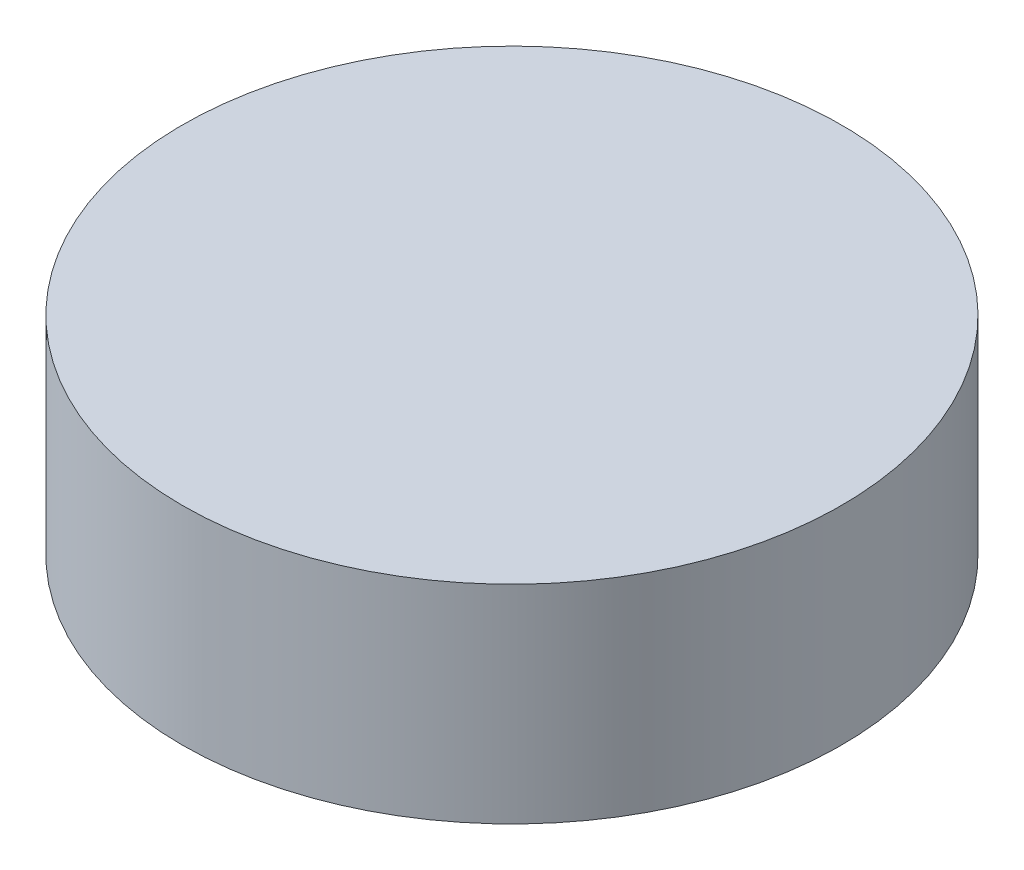
ISO-10303-21;
HEADER;
FILE_DESCRIPTION(('STEP AP214'),'2;1');
FILE_NAME('part.step','',(''),(''),'','','');
FILE_SCHEMA(('AUTOMOTIVE_DESIGN { 1 0 10303 214 1 1 1 1 }'));
ENDSEC;
DATA;
#1=APPLICATION_CONTEXT('core data for automotive mechanical design processes');
#2=APPLICATION_PROTOCOL_DEFINITION('international standard','automotive_design',2000,#1);
#3=PRODUCT_CONTEXT('',#1,'mechanical');
#4=PRODUCT('Part','Part','',(#3));
#5=PRODUCT_RELATED_PRODUCT_CATEGORY('part','',(#4));
#6=PRODUCT_DEFINITION_FORMATION('','',#4);
#7=PRODUCT_DEFINITION_CONTEXT('part definition',#1,'design');
#8=PRODUCT_DEFINITION('design','',#6,#7);
#9=PRODUCT_DEFINITION_SHAPE('','',#8);
#10=(LENGTH_UNIT() NAMED_UNIT(*) SI_UNIT(.MILLI.,.METRE.));
#11=(NAMED_UNIT(*) PLANE_ANGLE_UNIT() SI_UNIT($,.RADIAN.));
#12=(NAMED_UNIT(*) SI_UNIT($,.STERADIAN.) SOLID_ANGLE_UNIT());
#13=UNCERTAINTY_MEASURE_WITH_UNIT(LENGTH_MEASURE(1.E-05),#10,'distance_accuracy_value','');
#14=(GEOMETRIC_REPRESENTATION_CONTEXT(3) GLOBAL_UNCERTAINTY_ASSIGNED_CONTEXT((#13)) GLOBAL_UNIT_ASSIGNED_CONTEXT((#10,
#11,#12)) REPRESENTATION_CONTEXT('',''));
#15=CARTESIAN_POINT('',(0.,0.,0.));
#16=DIRECTION('',(0.,0.,1.));
#17=DIRECTION('',(1.,0.,0.));
#18=AXIS2_PLACEMENT_3D('',#15,#16,#17);
#19=CARTESIAN_POINT('',(0.,4.,0.));
#20=DIRECTION('',(0.,-1.,0.));
#21=DIRECTION('',(0.,0.,-1.));
#22=AXIS2_PLACEMENT_3D('',#19,#20,#21);
#23=CYLINDRICAL_SURFACE('',#22,6.35);
#24=CARTESIAN_POINT('',(0.,4.,0.));
#25=DIRECTION('',(0.,1.,0.));
#26=DIRECTION('',(0.,0.,1.));
#27=AXIS2_PLACEMENT_3D('',#24,#25,#26);
#28=CIRCLE('',#27,6.35);
#29=CARTESIAN_POINT('',(0.,4.,6.35));
#30=VERTEX_POINT('',#29);
#31=EDGE_CURVE('E12',#30,#30,#28,.T.);
#32=ORIENTED_EDGE('',*,*,#31,.F.);
#33=EDGE_LOOP('',(#32));
#34=FACE_BOUND('',#33,.T.);
#35=CARTESIAN_POINT('',(0.,0.,0.));
#36=DIRECTION('',(0.,1.,0.));
#37=DIRECTION('',(0.,0.,1.));
#38=AXIS2_PLACEMENT_3D('',#35,#36,#37);
#39=CIRCLE('',#38,6.35);
#40=CARTESIAN_POINT('',(0.,0.,6.35));
#41=VERTEX_POINT('',#40);
#42=EDGE_CURVE('E48',#41,#41,#39,.T.);
#43=ORIENTED_EDGE('',*,*,#42,.T.);
#44=EDGE_LOOP('',(#43));
#45=FACE_BOUND('',#44,.T.);
#46=ADVANCED_FACE('F45',(#34,#45),#23,.T.);
#47=CARTESIAN_POINT('',(0.,4.,0.));
#48=DIRECTION('',(0.,1.,0.));
#49=DIRECTION('',(0.,0.,1.));
#50=AXIS2_PLACEMENT_3D('',#47,#48,#49);
#51=PLANE('',#50);
#52=ORIENTED_EDGE('',*,*,#31,.T.);
#53=EDGE_LOOP('',(#52));
#54=FACE_BOUND('',#53,.T.);
#55=ADVANCED_FACE('F148',(#54),#51,.T.);
#56=CARTESIAN_POINT('',(0.,0.,0.));
#57=DIRECTION('',(0.,1.,0.));
#58=DIRECTION('',(0.,0.,1.));
#59=AXIS2_PLACEMENT_3D('',#56,#57,#58);
#60=PLANE('',#59);
#61=CARTESIAN_POINT('',(0.,0.,4.2));
#62=DIRECTION('',(0.,-1.,0.));
#63=DIRECTION('',(0.,0.,-1.));
#64=AXIS2_PLACEMENT_3D('',#61,#62,#63);
#65=CIRCLE('',#64,1.);
#66=CARTESIAN_POINT('',(0.992888545809194,0.,4.08095238095238));
#67=VERTEX_POINT('',#66);
#68=CARTESIAN_POINT('',(-0.992888545809194,0.,4.08095238095238));
#69=VERTEX_POINT('',#68);
#70=EDGE_CURVE('E102',#67,#69,#65,.T.);
#71=ORIENTED_EDGE('',*,*,#70,.F.);
#72=CARTESIAN_POINT('',(0.,0.,0.));
#73=DIRECTION('',(0.,-1.,0.));
#74=DIRECTION('',(0.,0.,-1.));
#75=AXIS2_PLACEMENT_3D('',#72,#73,#74);
#76=CIRCLE('',#75,4.2);
#77=CARTESIAN_POINT('',(0.992888545809194,0.,-4.08095238095238));
#78=VERTEX_POINT('',#77);
#79=EDGE_CURVE('E86',#78,#67,#76,.T.);
#80=ORIENTED_EDGE('',*,*,#79,.F.);
#81=CARTESIAN_POINT('',(0.,0.,-4.2));
#82=DIRECTION('',(0.,-1.,0.));
#83=DIRECTION('',(0.,0.,-1.));
#84=AXIS2_PLACEMENT_3D('',#81,#82,#83);
#85=CIRCLE('',#84,1.);
#86=CARTESIAN_POINT('',(-0.992888545809194,0.,-4.08095238095238));
#87=VERTEX_POINT('',#86);
#88=EDGE_CURVE('E122',#87,#78,#85,.T.);
#89=ORIENTED_EDGE('',*,*,#88,.F.);
#90=EDGE_CURVE('E96',#69,#87,#76,.T.);
#91=ORIENTED_EDGE('',*,*,#90,.F.);
#92=EDGE_LOOP('',(#71,#80,#89,#91));
#93=FACE_BOUND('',#92,.T.);
#94=ORIENTED_EDGE('',*,*,#42,.F.);
#95=EDGE_LOOP('',(#94));
#96=FACE_BOUND('',#95,.T.);
#97=ADVANCED_FACE('F107',(#93,#96),#60,.F.);
#98=CARTESIAN_POINT('',(0.,0.999999999999997,-4.2));
#99=DIRECTION('',(0.,-1.,0.));
#100=DIRECTION('',(0.,0.,-1.));
#101=AXIS2_PLACEMENT_3D('',#98,#99,#100);
#102=CYLINDRICAL_SURFACE('',#101,1.);
#103=CARTESIAN_POINT('',(0.,0.999999999999997,-4.2));
#104=DIRECTION('',(0.,-1.,0.));
#105=DIRECTION('',(0.,0.,-1.));
#106=AXIS2_PLACEMENT_3D('',#103,#104,#105);
#107=CIRCLE('',#106,1.);
#108=CARTESIAN_POINT('',(-0.992888545809193,0.999999999999997,-4.08095238095238));
#109=VERTEX_POINT('',#108);
#110=CARTESIAN_POINT('',(0.992888545809193,0.999999999999997,-4.08095238095238));
#111=VERTEX_POINT('',#110);
#112=EDGE_CURVE('E123',#109,#111,#107,.T.);
#113=ORIENTED_EDGE('',*,*,#112,.F.);
#114=DIRECTION('',(0.,-1.,0.));
#115=VECTOR('',#114,1.);
#116=CARTESIAN_POINT('',(-0.992888545809193,0.499999999999999,-4.08095238095238));
#117=LINE('',#116,#115);
#118=EDGE_CURVE('E118',#109,#87,#117,.T.);
#119=ORIENTED_EDGE('',*,*,#118,.T.);
#120=ORIENTED_EDGE('',*,*,#88,.T.);
#121=DIRECTION('',(0.,-1.,0.));
#122=VECTOR('',#121,1.);
#123=CARTESIAN_POINT('',(0.992888545809193,0.499999999999999,-4.08095238095238));
#124=LINE('',#123,#122);
#125=EDGE_CURVE('E68',#78,#111,#124,.F.);
#126=ORIENTED_EDGE('',*,*,#125,.T.);
#127=EDGE_LOOP('',(#113,#119,#120,#126));
#128=FACE_BOUND('',#127,.T.);
#129=ADVANCED_FACE('F129',(#128),#102,.F.);
#130=CARTESIAN_POINT('',(0.,0.999999999999997,-4.2));
#131=DIRECTION('',(0.,-1.,0.));
#132=DIRECTION('',(0.,0.,-1.));
#133=AXIS2_PLACEMENT_3D('',#130,#131,#132);
#134=PLANE('',#133);
#135=ORIENTED_EDGE('',*,*,#112,.T.);
#136=CARTESIAN_POINT('',(0.,0.999999999999997,0.));
#137=DIRECTION('',(0.,-1.,0.));
#138=DIRECTION('',(0.,0.,-1.));
#139=AXIS2_PLACEMENT_3D('',#136,#137,#138);
#140=CIRCLE('',#139,4.2);
#141=CARTESIAN_POINT('',(0.992888545809194,0.999999999999997,4.08095238095238));
#142=VERTEX_POINT('',#141);
#143=EDGE_CURVE('E133',#111,#142,#140,.T.);
#144=ORIENTED_EDGE('',*,*,#143,.T.);
#145=CARTESIAN_POINT('',(0.,0.999999999999997,4.2));
#146=DIRECTION('',(0.,-1.,0.));
#147=DIRECTION('',(0.,0.,-1.));
#148=AXIS2_PLACEMENT_3D('',#145,#146,#147);
#149=CIRCLE('',#148,1.);
#150=CARTESIAN_POINT('',(-0.992888545809194,0.999999999999997,4.08095238095238));
#151=VERTEX_POINT('',#150);
#152=EDGE_CURVE('E97',#142,#151,#149,.T.);
#153=ORIENTED_EDGE('',*,*,#152,.T.);
#154=EDGE_CURVE('E60',#151,#109,#140,.T.);
#155=ORIENTED_EDGE('',*,*,#154,.T.);
#156=EDGE_LOOP('',(#135,#144,#153,#155));
#157=FACE_BOUND('',#156,.T.);
#158=ADVANCED_FACE('F137',(#157),#134,.T.);
#159=CARTESIAN_POINT('',(0.,0.999999999999997,0.));
#160=DIRECTION('',(0.,-1.,0.));
#161=DIRECTION('',(0.,0.,-1.));
#162=AXIS2_PLACEMENT_3D('',#159,#160,#161);
#163=CYLINDRICAL_SURFACE('',#162,4.2);
#164=ORIENTED_EDGE('',*,*,#154,.F.);
#165=DIRECTION('',(0.,-1.,0.));
#166=VECTOR('',#165,1.);
#167=CARTESIAN_POINT('',(-0.992888545809193,0.499999999999999,4.08095238095238));
#168=LINE('',#167,#166);
#169=EDGE_CURVE('E105',#151,#69,#168,.T.);
#170=ORIENTED_EDGE('',*,*,#169,.T.);
#171=ORIENTED_EDGE('',*,*,#90,.T.);
#172=ORIENTED_EDGE('',*,*,#118,.F.);
#173=EDGE_LOOP('',(#164,#170,#171,#172));
#174=FACE_BOUND('',#173,.T.);
#175=ADVANCED_FACE('F131',(#174),#163,.F.);
#176=ORIENTED_EDGE('',*,*,#79,.T.);
#177=DIRECTION('',(0.,-1.,0.));
#178=VECTOR('',#177,1.);
#179=CARTESIAN_POINT('',(0.992888545809193,0.499999999999999,4.08095238095238));
#180=LINE('',#179,#178);
#181=EDGE_CURVE('E89',#67,#142,#180,.F.);
#182=ORIENTED_EDGE('',*,*,#181,.T.);
#183=ORIENTED_EDGE('',*,*,#143,.F.);
#184=ORIENTED_EDGE('',*,*,#125,.F.);
#185=EDGE_LOOP('',(#176,#182,#183,#184));
#186=FACE_BOUND('',#185,.T.);
#187=ADVANCED_FACE('F88',(#186),#163,.F.);
#188=CARTESIAN_POINT('',(0.,0.999999999999997,4.2));
#189=DIRECTION('',(0.,-1.,0.));
#190=DIRECTION('',(0.,0.,-1.));
#191=AXIS2_PLACEMENT_3D('',#188,#189,#190);
#192=CYLINDRICAL_SURFACE('',#191,1.);
#193=ORIENTED_EDGE('',*,*,#152,.F.);
#194=ORIENTED_EDGE('',*,*,#181,.F.);
#195=ORIENTED_EDGE('',*,*,#70,.T.);
#196=ORIENTED_EDGE('',*,*,#169,.F.);
#197=EDGE_LOOP('',(#193,#194,#195,#196));
#198=FACE_BOUND('',#197,.T.);
#199=ADVANCED_FACE('F101',(#198),#192,.F.);
#200=CLOSED_SHELL('',(#46,#55,#97,#129,#158,#175,#187,#199));
#201=MANIFOLD_SOLID_BREP('B2',#200);
#202=ADVANCED_BREP_SHAPE_REPRESENTATION('',(#18,#201),#14);
#203=SHAPE_DEFINITION_REPRESENTATION(#9,#202);
ENDSEC;
END-ISO-10303-21;
